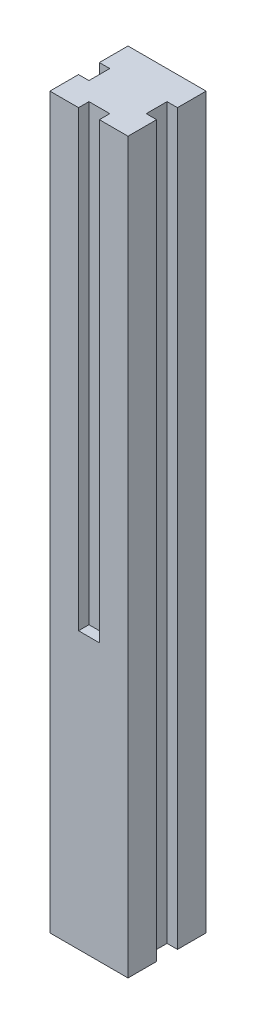
ISO-10303-21;
HEADER;
FILE_DESCRIPTION(('STEP AP214'),'2;1');
FILE_NAME('part.step','',(''),(''),'','','');
FILE_SCHEMA(('AUTOMOTIVE_DESIGN { 1 0 10303 214 1 1 1 1 }'));
ENDSEC;
DATA;
#1=APPLICATION_CONTEXT('core data for automotive mechanical design processes');
#2=APPLICATION_PROTOCOL_DEFINITION('international standard','automotive_design',2000,#1);
#3=PRODUCT_CONTEXT('',#1,'mechanical');
#4=PRODUCT('Part','Part','',(#3));
#5=PRODUCT_RELATED_PRODUCT_CATEGORY('part','',(#4));
#6=PRODUCT_DEFINITION_FORMATION('','',#4);
#7=PRODUCT_DEFINITION_CONTEXT('part definition',#1,'design');
#8=PRODUCT_DEFINITION('design','',#6,#7);
#9=PRODUCT_DEFINITION_SHAPE('','',#8);
#10=(LENGTH_UNIT() NAMED_UNIT(*) SI_UNIT(.MILLI.,.METRE.));
#11=(NAMED_UNIT(*) PLANE_ANGLE_UNIT() SI_UNIT($,.RADIAN.));
#12=(NAMED_UNIT(*) SI_UNIT($,.STERADIAN.) SOLID_ANGLE_UNIT());
#13=UNCERTAINTY_MEASURE_WITH_UNIT(LENGTH_MEASURE(1.E-05),#10,'distance_accuracy_value','');
#14=(GEOMETRIC_REPRESENTATION_CONTEXT(3) GLOBAL_UNCERTAINTY_ASSIGNED_CONTEXT((#13)) GLOBAL_UNIT_ASSIGNED_CONTEXT((#10,
#11,#12)) REPRESENTATION_CONTEXT('',''));
#15=CARTESIAN_POINT('',(0.,0.,0.));
#16=DIRECTION('',(0.,0.,1.));
#17=DIRECTION('',(1.,0.,0.));
#18=AXIS2_PLACEMENT_3D('',#15,#16,#17);
#19=CARTESIAN_POINT('',(37.5,700.,37.5));
#20=DIRECTION('',(-1.,0.,0.));
#21=DIRECTION('',(0.,0.,1.));
#22=AXIS2_PLACEMENT_3D('',#19,#20,#21);
#23=PLANE('',#22);
#24=DIRECTION('',(0.,0.,-1.));
#25=VECTOR('',#24,1.);
#26=CARTESIAN_POINT('',(37.5,700.,37.5));
#27=LINE('',#26,#25);
#28=CARTESIAN_POINT('',(37.5,700.,-10.));
#29=VERTEX_POINT('',#28);
#30=CARTESIAN_POINT('',(37.5,700.,-37.5));
#31=VERTEX_POINT('',#30);
#32=EDGE_CURVE('E251',#29,#31,#27,.T.);
#33=ORIENTED_EDGE('',*,*,#32,.F.);
#34=DIRECTION('',(0.,1.,0.));
#35=VECTOR('',#34,1.);
#36=CARTESIAN_POINT('',(37.5,0.,-10.));
#37=LINE('',#36,#35);
#38=CARTESIAN_POINT('',(37.5,0.,-10.));
#39=VERTEX_POINT('',#38);
#40=EDGE_CURVE('E185',#39,#29,#37,.T.);
#41=ORIENTED_EDGE('',*,*,#40,.F.);
#42=DIRECTION('',(0.,0.,-1.));
#43=VECTOR('',#42,1.);
#44=CARTESIAN_POINT('',(37.5,0.,37.5));
#45=LINE('',#44,#43);
#46=CARTESIAN_POINT('',(37.5,0.,-37.5));
#47=VERTEX_POINT('',#46);
#48=EDGE_CURVE('E203',#39,#47,#45,.T.);
#49=ORIENTED_EDGE('',*,*,#48,.T.);
#50=DIRECTION('',(0.,-1.,0.));
#51=VECTOR('',#50,1.);
#52=CARTESIAN_POINT('',(37.5,700.,-37.5));
#53=LINE('',#52,#51);
#54=EDGE_CURVE('E12',#31,#47,#53,.T.);
#55=ORIENTED_EDGE('',*,*,#54,.F.);
#56=EDGE_LOOP('',(#33,#41,#49,#55));
#57=FACE_BOUND('',#56,.T.);
#58=ADVANCED_FACE('F41',(#57),#23,.F.);
#59=CARTESIAN_POINT('',(-37.5,700.,37.5));
#60=DIRECTION('',(1.,0.,0.));
#61=DIRECTION('',(0.,0.,-1.));
#62=AXIS2_PLACEMENT_3D('',#59,#60,#61);
#63=PLANE('',#62);
#64=DIRECTION('',(0.,1.,0.));
#65=VECTOR('',#64,1.);
#66=CARTESIAN_POINT('',(-37.5,-22.3606797749979,10.));
#67=LINE('',#66,#65);
#68=CARTESIAN_POINT('',(-37.5,265.,10.));
#69=VERTEX_POINT('',#68);
#70=CARTESIAN_POINT('',(-37.5,700.,10.));
#71=VERTEX_POINT('',#70);
#72=EDGE_CURVE('E228',#69,#71,#67,.T.);
#73=ORIENTED_EDGE('',*,*,#72,.F.);
#74=DIRECTION('',(0.,0.,-1.));
#75=VECTOR('',#74,1.);
#76=CARTESIAN_POINT('',(-37.5,265.,10.));
#77=LINE('',#76,#75);
#78=CARTESIAN_POINT('',(-37.5,265.,-10.));
#79=VERTEX_POINT('',#78);
#80=EDGE_CURVE('E236',#69,#79,#77,.T.);
#81=ORIENTED_EDGE('',*,*,#80,.T.);
#82=DIRECTION('',(0.,1.,0.));
#83=VECTOR('',#82,1.);
#84=CARTESIAN_POINT('',(-37.5,-22.3606797749979,-10.));
#85=LINE('',#84,#83);
#86=CARTESIAN_POINT('',(-37.5,700.,-10.));
#87=VERTEX_POINT('',#86);
#88=EDGE_CURVE('E225',#79,#87,#85,.T.);
#89=ORIENTED_EDGE('',*,*,#88,.T.);
#90=DIRECTION('',(0.,0.,1.));
#91=VECTOR('',#90,1.);
#92=CARTESIAN_POINT('',(-37.5,700.,37.5));
#93=LINE('',#92,#91);
#94=CARTESIAN_POINT('',(-37.5,700.,-37.5));
#95=VERTEX_POINT('',#94);
#96=EDGE_CURVE('E254',#95,#87,#93,.T.);
#97=ORIENTED_EDGE('',*,*,#96,.F.);
#98=DIRECTION('',(0.,-1.,0.));
#99=VECTOR('',#98,1.);
#100=CARTESIAN_POINT('',(-37.5,700.,-37.5));
#101=LINE('',#100,#99);
#102=CARTESIAN_POINT('',(-37.5,0.,-37.5));
#103=VERTEX_POINT('',#102);
#104=EDGE_CURVE('E49',#95,#103,#101,.T.);
#105=ORIENTED_EDGE('',*,*,#104,.T.);
#106=DIRECTION('',(0.,0.,1.));
#107=VECTOR('',#106,1.);
#108=CARTESIAN_POINT('',(-37.5,0.,37.5));
#109=LINE('',#108,#107);
#110=CARTESIAN_POINT('',(-37.5,0.,37.5));
#111=VERTEX_POINT('',#110);
#112=EDGE_CURVE('E266',#103,#111,#109,.T.);
#113=ORIENTED_EDGE('',*,*,#112,.T.);
#114=DIRECTION('',(0.,-1.,0.));
#115=VECTOR('',#114,1.);
#116=CARTESIAN_POINT('',(-37.5,700.,37.5));
#117=LINE('',#116,#115);
#118=CARTESIAN_POINT('',(-37.5,700.,37.5));
#119=VERTEX_POINT('',#118);
#120=EDGE_CURVE('E272',#119,#111,#117,.T.);
#121=ORIENTED_EDGE('',*,*,#120,.F.);
#122=EDGE_CURVE('E253',#71,#119,#93,.T.);
#123=ORIENTED_EDGE('',*,*,#122,.F.);
#124=EDGE_LOOP('',(#73,#81,#89,#97,#105,#113,#121,#123));
#125=FACE_BOUND('',#124,.T.);
#126=ADVANCED_FACE('F280',(#125),#63,.F.);
#127=CARTESIAN_POINT('',(-37.5,700.,37.5));
#128=DIRECTION('',(0.,0.,-1.));
#129=DIRECTION('',(-1.,0.,0.));
#130=AXIS2_PLACEMENT_3D('',#127,#128,#129);
#131=PLANE('',#130);
#132=DIRECTION('',(0.,1.,0.));
#133=VECTOR('',#132,1.);
#134=CARTESIAN_POINT('',(10.,-22.3606797749979,37.5));
#135=LINE('',#134,#133);
#136=CARTESIAN_POINT('',(10.,265.,37.5));
#137=VERTEX_POINT('',#136);
#138=CARTESIAN_POINT('',(10.,700.,37.5));
#139=VERTEX_POINT('',#138);
#140=EDGE_CURVE('E198',#137,#139,#135,.T.);
#141=ORIENTED_EDGE('',*,*,#140,.F.);
#142=DIRECTION('',(-1.,0.,0.));
#143=VECTOR('',#142,1.);
#144=CARTESIAN_POINT('',(10.,265.,37.5));
#145=LINE('',#144,#143);
#146=CARTESIAN_POINT('',(-10.,265.,37.5));
#147=VERTEX_POINT('',#146);
#148=EDGE_CURVE('E204',#137,#147,#145,.T.);
#149=ORIENTED_EDGE('',*,*,#148,.T.);
#150=DIRECTION('',(0.,1.,0.));
#151=VECTOR('',#150,1.);
#152=CARTESIAN_POINT('',(-10.,-22.3606797749979,37.5));
#153=LINE('',#152,#151);
#154=CARTESIAN_POINT('',(-10.,700.,37.5));
#155=VERTEX_POINT('',#154);
#156=EDGE_CURVE('E196',#147,#155,#153,.T.);
#157=ORIENTED_EDGE('',*,*,#156,.T.);
#158=DIRECTION('',(1.,0.,0.));
#159=VECTOR('',#158,1.);
#160=CARTESIAN_POINT('',(-37.5,700.,37.5));
#161=LINE('',#160,#159);
#162=EDGE_CURVE('E258',#119,#155,#161,.T.);
#163=ORIENTED_EDGE('',*,*,#162,.F.);
#164=ORIENTED_EDGE('',*,*,#120,.T.);
#165=DIRECTION('',(1.,0.,0.));
#166=VECTOR('',#165,1.);
#167=CARTESIAN_POINT('',(-37.5,0.,37.5));
#168=LINE('',#167,#166);
#169=CARTESIAN_POINT('',(37.5,0.,37.5));
#170=VERTEX_POINT('',#169);
#171=EDGE_CURVE('E268',#111,#170,#168,.T.);
#172=ORIENTED_EDGE('',*,*,#171,.T.);
#173=DIRECTION('',(0.,-1.,0.));
#174=VECTOR('',#173,1.);
#175=CARTESIAN_POINT('',(37.5,700.,37.5));
#176=LINE('',#175,#174);
#177=CARTESIAN_POINT('',(37.5,700.,37.5));
#178=VERTEX_POINT('',#177);
#179=EDGE_CURVE('E261',#178,#170,#176,.T.);
#180=ORIENTED_EDGE('',*,*,#179,.F.);
#181=EDGE_CURVE('E257',#139,#178,#161,.T.);
#182=ORIENTED_EDGE('',*,*,#181,.F.);
#183=EDGE_LOOP('',(#141,#149,#157,#163,#164,#172,#180,#182));
#184=FACE_BOUND('',#183,.T.);
#185=ADVANCED_FACE('F289',(#184),#131,.F.);
#186=CARTESIAN_POINT('',(0.,700.,0.));
#187=DIRECTION('',(0.,-1.,0.));
#188=DIRECTION('',(0.,0.,-1.));
#189=AXIS2_PLACEMENT_3D('',#186,#187,#188);
#190=PLANE('',#189);
#191=DIRECTION('',(0.,0.,1.));
#192=VECTOR('',#191,1.);
#193=CARTESIAN_POINT('',(27.5,700.,0.));
#194=LINE('',#193,#192);
#195=CARTESIAN_POINT('',(27.5,700.,-10.));
#196=VERTEX_POINT('',#195);
#197=CARTESIAN_POINT('',(27.5,700.,10.));
#198=VERTEX_POINT('',#197);
#199=EDGE_CURVE('E161',#196,#198,#194,.T.);
#200=ORIENTED_EDGE('',*,*,#199,.F.);
#201=DIRECTION('',(-1.,0.,0.));
#202=VECTOR('',#201,1.);
#203=CARTESIAN_POINT('',(0.,700.,-10.));
#204=LINE('',#203,#202);
#205=EDGE_CURVE('E173',#29,#196,#204,.T.);
#206=ORIENTED_EDGE('',*,*,#205,.F.);
#207=ORIENTED_EDGE('',*,*,#32,.T.);
#208=DIRECTION('',(-1.,0.,0.));
#209=VECTOR('',#208,1.);
#210=CARTESIAN_POINT('',(-37.5,700.,-37.5));
#211=LINE('',#210,#209);
#212=EDGE_CURVE('E250',#31,#95,#211,.T.);
#213=ORIENTED_EDGE('',*,*,#212,.T.);
#214=ORIENTED_EDGE('',*,*,#96,.T.);
#215=DIRECTION('',(1.,0.,0.));
#216=VECTOR('',#215,1.);
#217=CARTESIAN_POINT('',(-37.5,700.,-10.));
#218=LINE('',#217,#216);
#219=CARTESIAN_POINT('',(-27.5,700.,-10.));
#220=VERTEX_POINT('',#219);
#221=EDGE_CURVE('E223',#87,#220,#218,.T.);
#222=ORIENTED_EDGE('',*,*,#221,.T.);
#223=DIRECTION('',(0.,0.,1.));
#224=VECTOR('',#223,1.);
#225=CARTESIAN_POINT('',(-27.5,700.,-10.));
#226=LINE('',#225,#224);
#227=CARTESIAN_POINT('',(-27.5,700.,10.));
#228=VERTEX_POINT('',#227);
#229=EDGE_CURVE('E224',#220,#228,#226,.T.);
#230=ORIENTED_EDGE('',*,*,#229,.T.);
#231=DIRECTION('',(-1.,0.,0.));
#232=VECTOR('',#231,1.);
#233=CARTESIAN_POINT('',(-27.5,700.,10.));
#234=LINE('',#233,#232);
#235=EDGE_CURVE('E220',#228,#71,#234,.T.);
#236=ORIENTED_EDGE('',*,*,#235,.T.);
#237=ORIENTED_EDGE('',*,*,#122,.T.);
#238=ORIENTED_EDGE('',*,*,#162,.T.);
#239=DIRECTION('',(0.,0.,-1.));
#240=VECTOR('',#239,1.);
#241=CARTESIAN_POINT('',(-10.,700.,37.5));
#242=LINE('',#241,#240);
#243=CARTESIAN_POINT('',(-10.,700.,27.5));
#244=VERTEX_POINT('',#243);
#245=EDGE_CURVE('E193',#155,#244,#242,.T.);
#246=ORIENTED_EDGE('',*,*,#245,.T.);
#247=DIRECTION('',(1.,0.,0.));
#248=VECTOR('',#247,1.);
#249=CARTESIAN_POINT('',(-10.,700.,27.5));
#250=LINE('',#249,#248);
#251=CARTESIAN_POINT('',(10.,700.,27.5));
#252=VERTEX_POINT('',#251);
#253=EDGE_CURVE('E188',#244,#252,#250,.T.);
#254=ORIENTED_EDGE('',*,*,#253,.T.);
#255=DIRECTION('',(0.,0.,1.));
#256=VECTOR('',#255,1.);
#257=CARTESIAN_POINT('',(10.,700.,27.5));
#258=LINE('',#257,#256);
#259=EDGE_CURVE('E64',#252,#139,#258,.T.);
#260=ORIENTED_EDGE('',*,*,#259,.T.);
#261=ORIENTED_EDGE('',*,*,#181,.T.);
#262=CARTESIAN_POINT('',(37.5,700.,10.));
#263=VERTEX_POINT('',#262);
#264=EDGE_CURVE('E247',#178,#263,#27,.T.);
#265=ORIENTED_EDGE('',*,*,#264,.T.);
#266=DIRECTION('',(1.,0.,0.));
#267=VECTOR('',#266,1.);
#268=CARTESIAN_POINT('',(0.,700.,10.));
#269=LINE('',#268,#267);
#270=EDGE_CURVE('E176',#198,#263,#269,.T.);
#271=ORIENTED_EDGE('',*,*,#270,.F.);
#272=EDGE_LOOP('',(#200,#206,#207,#213,#214,#222,#230,#236,#237,#238,#246,#254,#260,#261,#265,#271));
#273=FACE_BOUND('',#272,.T.);
#274=ADVANCED_FACE('F295',(#273),#190,.F.);
#275=CARTESIAN_POINT('',(37.5,0.,10.));
#276=VERTEX_POINT('',#275);
#277=EDGE_CURVE('E262',#170,#276,#45,.T.);
#278=ORIENTED_EDGE('',*,*,#277,.T.);
#279=DIRECTION('',(0.,1.,0.));
#280=VECTOR('',#279,1.);
#281=CARTESIAN_POINT('',(37.5,0.,10.));
#282=LINE('',#281,#280);
#283=EDGE_CURVE('E56',#276,#263,#282,.T.);
#284=ORIENTED_EDGE('',*,*,#283,.T.);
#285=ORIENTED_EDGE('',*,*,#264,.F.);
#286=ORIENTED_EDGE('',*,*,#179,.T.);
#287=EDGE_LOOP('',(#278,#284,#285,#286));
#288=FACE_BOUND('',#287,.T.);
#289=ADVANCED_FACE('F43',(#288),#23,.F.);
#290=CARTESIAN_POINT('',(-37.5,700.,-37.5));
#291=DIRECTION('',(0.,0.,1.));
#292=DIRECTION('',(1.,0.,0.));
#293=AXIS2_PLACEMENT_3D('',#290,#291,#292);
#294=PLANE('',#293);
#295=DIRECTION('',(-1.,0.,0.));
#296=VECTOR('',#295,1.);
#297=CARTESIAN_POINT('',(-37.5,0.,-37.5));
#298=LINE('',#297,#296);
#299=EDGE_CURVE('E264',#47,#103,#298,.T.);
#300=ORIENTED_EDGE('',*,*,#299,.T.);
#301=ORIENTED_EDGE('',*,*,#104,.F.);
#302=ORIENTED_EDGE('',*,*,#212,.F.);
#303=ORIENTED_EDGE('',*,*,#54,.T.);
#304=EDGE_LOOP('',(#300,#301,#302,#303));
#305=FACE_BOUND('',#304,.T.);
#306=ADVANCED_FACE('F323',(#305),#294,.F.);
#307=CARTESIAN_POINT('',(0.,0.,0.));
#308=DIRECTION('',(0.,-1.,0.));
#309=DIRECTION('',(0.,0.,-1.));
#310=AXIS2_PLACEMENT_3D('',#307,#308,#309);
#311=PLANE('',#310);
#312=DIRECTION('',(-1.,0.,0.));
#313=VECTOR('',#312,1.);
#314=CARTESIAN_POINT('',(0.,0.,-10.));
#315=LINE('',#314,#313);
#316=CARTESIAN_POINT('',(27.5,0.,-10.));
#317=VERTEX_POINT('',#316);
#318=EDGE_CURVE('E163',#39,#317,#315,.T.);
#319=ORIENTED_EDGE('',*,*,#318,.T.);
#320=DIRECTION('',(0.,0.,1.));
#321=VECTOR('',#320,1.);
#322=CARTESIAN_POINT('',(27.5,0.,0.));
#323=LINE('',#322,#321);
#324=CARTESIAN_POINT('',(27.5,0.,10.));
#325=VERTEX_POINT('',#324);
#326=EDGE_CURVE('E158',#317,#325,#323,.T.);
#327=ORIENTED_EDGE('',*,*,#326,.T.);
#328=DIRECTION('',(1.,0.,0.));
#329=VECTOR('',#328,1.);
#330=CARTESIAN_POINT('',(0.,0.,10.));
#331=LINE('',#330,#329);
#332=EDGE_CURVE('E165',#325,#276,#331,.T.);
#333=ORIENTED_EDGE('',*,*,#332,.T.);
#334=ORIENTED_EDGE('',*,*,#277,.F.);
#335=ORIENTED_EDGE('',*,*,#171,.F.);
#336=ORIENTED_EDGE('',*,*,#112,.F.);
#337=ORIENTED_EDGE('',*,*,#299,.F.);
#338=ORIENTED_EDGE('',*,*,#48,.F.);
#339=EDGE_LOOP('',(#319,#327,#333,#334,#335,#336,#337,#338));
#340=FACE_BOUND('',#339,.T.);
#341=ADVANCED_FACE('F171',(#340),#311,.T.);
#342=CARTESIAN_POINT('',(-27.5,-22.3606797749979,10.));
#343=DIRECTION('',(0.,0.,-1.));
#344=DIRECTION('',(-1.,0.,0.));
#345=AXIS2_PLACEMENT_3D('',#342,#343,#344);
#346=PLANE('',#345);
#347=DIRECTION('',(-1.,0.,0.));
#348=VECTOR('',#347,1.);
#349=CARTESIAN_POINT('',(-27.5,265.,10.));
#350=LINE('',#349,#348);
#351=CARTESIAN_POINT('',(-27.5,265.,10.));
#352=VERTEX_POINT('',#351);
#353=EDGE_CURVE('E233',#352,#69,#350,.T.);
#354=ORIENTED_EDGE('',*,*,#353,.T.);
#355=ORIENTED_EDGE('',*,*,#72,.T.);
#356=ORIENTED_EDGE('',*,*,#235,.F.);
#357=DIRECTION('',(0.,1.,0.));
#358=VECTOR('',#357,1.);
#359=CARTESIAN_POINT('',(-27.5,-22.3606797749979,10.));
#360=LINE('',#359,#358);
#361=EDGE_CURVE('E217',#352,#228,#360,.T.);
#362=ORIENTED_EDGE('',*,*,#361,.F.);
#363=EDGE_LOOP('',(#354,#355,#356,#362));
#364=FACE_BOUND('',#363,.T.);
#365=ADVANCED_FACE('F309',(#364),#346,.T.);
#366=CARTESIAN_POINT('',(-37.5,-22.3606797749979,-10.));
#367=DIRECTION('',(0.,0.,1.));
#368=DIRECTION('',(1.,0.,0.));
#369=AXIS2_PLACEMENT_3D('',#366,#367,#368);
#370=PLANE('',#369);
#371=DIRECTION('',(1.,0.,0.));
#372=VECTOR('',#371,1.);
#373=CARTESIAN_POINT('',(-37.5,265.,-10.));
#374=LINE('',#373,#372);
#375=CARTESIAN_POINT('',(-27.5,265.,-10.));
#376=VERTEX_POINT('',#375);
#377=EDGE_CURVE('E184',#79,#376,#374,.T.);
#378=ORIENTED_EDGE('',*,*,#377,.T.);
#379=DIRECTION('',(0.,1.,0.));
#380=VECTOR('',#379,1.);
#381=CARTESIAN_POINT('',(-27.5,-22.3606797749979,-10.));
#382=LINE('',#381,#380);
#383=EDGE_CURVE('E221',#376,#220,#382,.T.);
#384=ORIENTED_EDGE('',*,*,#383,.T.);
#385=ORIENTED_EDGE('',*,*,#221,.F.);
#386=ORIENTED_EDGE('',*,*,#88,.F.);
#387=EDGE_LOOP('',(#378,#384,#385,#386));
#388=FACE_BOUND('',#387,.T.);
#389=ADVANCED_FACE('F318',(#388),#370,.T.);
#390=CARTESIAN_POINT('',(-27.5,-22.3606797749979,-10.));
#391=DIRECTION('',(-1.,0.,0.));
#392=DIRECTION('',(0.,0.,1.));
#393=AXIS2_PLACEMENT_3D('',#390,#391,#392);
#394=PLANE('',#393);
#395=DIRECTION('',(0.,0.,1.));
#396=VECTOR('',#395,1.);
#397=CARTESIAN_POINT('',(-27.5,265.,-10.));
#398=LINE('',#397,#396);
#399=EDGE_CURVE('E230',#376,#352,#398,.T.);
#400=ORIENTED_EDGE('',*,*,#399,.T.);
#401=ORIENTED_EDGE('',*,*,#361,.T.);
#402=ORIENTED_EDGE('',*,*,#229,.F.);
#403=ORIENTED_EDGE('',*,*,#383,.F.);
#404=EDGE_LOOP('',(#400,#401,#402,#403));
#405=FACE_BOUND('',#404,.T.);
#406=ADVANCED_FACE('F315',(#405),#394,.T.);
#407=CARTESIAN_POINT('',(0.,265.,0.));
#408=DIRECTION('',(0.,-1.,0.));
#409=DIRECTION('',(0.,0.,-1.));
#410=AXIS2_PLACEMENT_3D('',#407,#408,#409);
#411=PLANE('',#410);
#412=ORIENTED_EDGE('',*,*,#399,.F.);
#413=ORIENTED_EDGE('',*,*,#377,.F.);
#414=ORIENTED_EDGE('',*,*,#80,.F.);
#415=ORIENTED_EDGE('',*,*,#353,.F.);
#416=EDGE_LOOP('',(#412,#413,#414,#415));
#417=FACE_BOUND('',#416,.T.);
#418=ADVANCED_FACE('F313',(#417),#411,.F.);
#419=CARTESIAN_POINT('',(10.,-22.3606797749979,27.5));
#420=DIRECTION('',(-1.,0.,0.));
#421=DIRECTION('',(0.,0.,1.));
#422=AXIS2_PLACEMENT_3D('',#419,#420,#421);
#423=PLANE('',#422);
#424=DIRECTION('',(0.,0.,1.));
#425=VECTOR('',#424,1.);
#426=CARTESIAN_POINT('',(10.,265.,27.5));
#427=LINE('',#426,#425);
#428=CARTESIAN_POINT('',(10.,265.,27.5));
#429=VERTEX_POINT('',#428);
#430=EDGE_CURVE('E207',#429,#137,#427,.T.);
#431=ORIENTED_EDGE('',*,*,#430,.T.);
#432=ORIENTED_EDGE('',*,*,#140,.T.);
#433=ORIENTED_EDGE('',*,*,#259,.F.);
#434=DIRECTION('',(0.,1.,0.));
#435=VECTOR('',#434,1.);
#436=CARTESIAN_POINT('',(10.,-22.3606797749979,27.5));
#437=LINE('',#436,#435);
#438=EDGE_CURVE('E199',#429,#252,#437,.T.);
#439=ORIENTED_EDGE('',*,*,#438,.F.);
#440=EDGE_LOOP('',(#431,#432,#433,#439));
#441=FACE_BOUND('',#440,.T.);
#442=ADVANCED_FACE('F296',(#441),#423,.T.);
#443=CARTESIAN_POINT('',(-10.,-22.3606797749979,37.5));
#444=DIRECTION('',(1.,0.,0.));
#445=DIRECTION('',(0.,0.,-1.));
#446=AXIS2_PLACEMENT_3D('',#443,#444,#445);
#447=PLANE('',#446);
#448=DIRECTION('',(0.,0.,-1.));
#449=VECTOR('',#448,1.);
#450=CARTESIAN_POINT('',(-10.,265.,37.5));
#451=LINE('',#450,#449);
#452=CARTESIAN_POINT('',(-10.,265.,27.5));
#453=VERTEX_POINT('',#452);
#454=EDGE_CURVE('E200',#147,#453,#451,.T.);
#455=ORIENTED_EDGE('',*,*,#454,.T.);
#456=DIRECTION('',(0.,1.,0.));
#457=VECTOR('',#456,1.);
#458=CARTESIAN_POINT('',(-10.,-22.3606797749979,27.5));
#459=LINE('',#458,#457);
#460=EDGE_CURVE('E192',#453,#244,#459,.T.);
#461=ORIENTED_EDGE('',*,*,#460,.T.);
#462=ORIENTED_EDGE('',*,*,#245,.F.);
#463=ORIENTED_EDGE('',*,*,#156,.F.);
#464=EDGE_LOOP('',(#455,#461,#462,#463));
#465=FACE_BOUND('',#464,.T.);
#466=ADVANCED_FACE('F305',(#465),#447,.T.);
#467=CARTESIAN_POINT('',(-10.,-22.3606797749979,27.5));
#468=DIRECTION('',(0.,0.,1.));
#469=DIRECTION('',(1.,0.,0.));
#470=AXIS2_PLACEMENT_3D('',#467,#468,#469);
#471=PLANE('',#470);
#472=DIRECTION('',(1.,0.,0.));
#473=VECTOR('',#472,1.);
#474=CARTESIAN_POINT('',(-10.,265.,27.5));
#475=LINE('',#474,#473);
#476=EDGE_CURVE('E191',#453,#429,#475,.T.);
#477=ORIENTED_EDGE('',*,*,#476,.T.);
#478=ORIENTED_EDGE('',*,*,#438,.T.);
#479=ORIENTED_EDGE('',*,*,#253,.F.);
#480=ORIENTED_EDGE('',*,*,#460,.F.);
#481=EDGE_LOOP('',(#477,#478,#479,#480));
#482=FACE_BOUND('',#481,.T.);
#483=ADVANCED_FACE('F302',(#482),#471,.T.);
#484=CARTESIAN_POINT('',(0.,265.,0.));
#485=DIRECTION('',(0.,-1.,0.));
#486=DIRECTION('',(0.,0.,-1.));
#487=AXIS2_PLACEMENT_3D('',#484,#485,#486);
#488=PLANE('',#487);
#489=ORIENTED_EDGE('',*,*,#476,.F.);
#490=ORIENTED_EDGE('',*,*,#454,.F.);
#491=ORIENTED_EDGE('',*,*,#148,.F.);
#492=ORIENTED_EDGE('',*,*,#430,.F.);
#493=EDGE_LOOP('',(#489,#490,#491,#492));
#494=FACE_BOUND('',#493,.T.);
#495=ADVANCED_FACE('F300',(#494),#488,.F.);
#496=CARTESIAN_POINT('',(27.5,0.,0.));
#497=DIRECTION('',(-1.,0.,0.));
#498=DIRECTION('',(0.,0.,1.));
#499=AXIS2_PLACEMENT_3D('',#496,#497,#498);
#500=PLANE('',#499);
#501=ORIENTED_EDGE('',*,*,#199,.T.);
#502=DIRECTION('',(0.,1.,0.));
#503=VECTOR('',#502,1.);
#504=CARTESIAN_POINT('',(27.5,0.,10.));
#505=LINE('',#504,#503);
#506=EDGE_CURVE('E155',#325,#198,#505,.T.);
#507=ORIENTED_EDGE('',*,*,#506,.F.);
#508=ORIENTED_EDGE('',*,*,#326,.F.);
#509=DIRECTION('',(0.,1.,0.));
#510=VECTOR('',#509,1.);
#511=CARTESIAN_POINT('',(27.5,0.,-10.));
#512=LINE('',#511,#510);
#513=EDGE_CURVE('E182',#317,#196,#512,.T.);
#514=ORIENTED_EDGE('',*,*,#513,.T.);
#515=EDGE_LOOP('',(#501,#507,#508,#514));
#516=FACE_BOUND('',#515,.T.);
#517=ADVANCED_FACE('F156',(#516),#500,.F.);
#518=CARTESIAN_POINT('',(0.,0.,-10.));
#519=DIRECTION('',(0.,0.,-1.));
#520=DIRECTION('',(-1.,0.,0.));
#521=AXIS2_PLACEMENT_3D('',#518,#519,#520);
#522=PLANE('',#521);
#523=ORIENTED_EDGE('',*,*,#205,.T.);
#524=ORIENTED_EDGE('',*,*,#513,.F.);
#525=ORIENTED_EDGE('',*,*,#318,.F.);
#526=ORIENTED_EDGE('',*,*,#40,.T.);
#527=EDGE_LOOP('',(#523,#524,#525,#526));
#528=FACE_BOUND('',#527,.T.);
#529=ADVANCED_FACE('F327',(#528),#522,.F.);
#530=CARTESIAN_POINT('',(0.,0.,10.));
#531=DIRECTION('',(0.,0.,1.));
#532=DIRECTION('',(1.,0.,0.));
#533=AXIS2_PLACEMENT_3D('',#530,#531,#532);
#534=PLANE('',#533);
#535=ORIENTED_EDGE('',*,*,#270,.T.);
#536=ORIENTED_EDGE('',*,*,#283,.F.);
#537=ORIENTED_EDGE('',*,*,#332,.F.);
#538=ORIENTED_EDGE('',*,*,#506,.T.);
#539=EDGE_LOOP('',(#535,#536,#537,#538));
#540=FACE_BOUND('',#539,.T.);
#541=ADVANCED_FACE('F166',(#540),#534,.F.);
#542=CLOSED_SHELL('',(#58,#126,#185,#274,#289,#306,#341,#365,#389,#406,#418,#442,#466,#483,#495,
#517,#529,#541));
#543=MANIFOLD_SOLID_BREP('B2',#542);
#544=ADVANCED_BREP_SHAPE_REPRESENTATION('',(#18,#543),#14);
#545=SHAPE_DEFINITION_REPRESENTATION(#9,#544);
ENDSEC;
END-ISO-10303-21;
